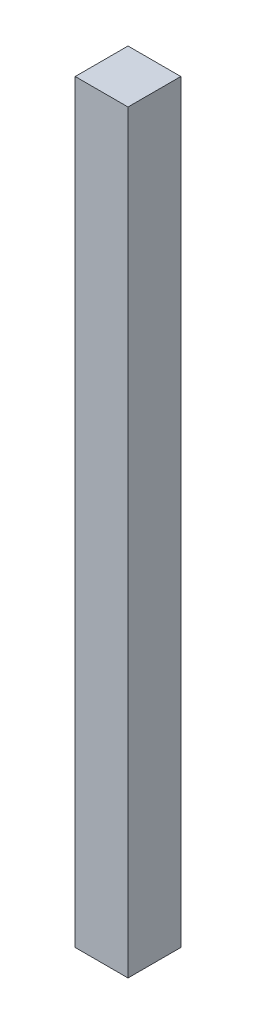
ISO-10303-21;
HEADER;
FILE_DESCRIPTION(('STEP AP214'),'2;1');
FILE_NAME('part.step','',(''),(''),'','','');
FILE_SCHEMA(('AUTOMOTIVE_DESIGN { 1 0 10303 214 1 1 1 1 }'));
ENDSEC;
DATA;
#1=APPLICATION_CONTEXT('core data for automotive mechanical design processes');
#2=APPLICATION_PROTOCOL_DEFINITION('international standard','automotive_design',2000,#1);
#3=PRODUCT_CONTEXT('',#1,'mechanical');
#4=PRODUCT('Part','Part','',(#3));
#5=PRODUCT_RELATED_PRODUCT_CATEGORY('part','',(#4));
#6=PRODUCT_DEFINITION_FORMATION('','',#4);
#7=PRODUCT_DEFINITION_CONTEXT('part definition',#1,'design');
#8=PRODUCT_DEFINITION('design','',#6,#7);
#9=PRODUCT_DEFINITION_SHAPE('','',#8);
#10=(LENGTH_UNIT() NAMED_UNIT(*) SI_UNIT(.MILLI.,.METRE.));
#11=(NAMED_UNIT(*) PLANE_ANGLE_UNIT() SI_UNIT($,.RADIAN.));
#12=(NAMED_UNIT(*) SI_UNIT($,.STERADIAN.) SOLID_ANGLE_UNIT());
#13=UNCERTAINTY_MEASURE_WITH_UNIT(LENGTH_MEASURE(1.E-05),#10,'distance_accuracy_value','');
#14=(GEOMETRIC_REPRESENTATION_CONTEXT(3) GLOBAL_UNCERTAINTY_ASSIGNED_CONTEXT((#13)) GLOBAL_UNIT_ASSIGNED_CONTEXT((#10,
#11,#12)) REPRESENTATION_CONTEXT('',''));
#15=CARTESIAN_POINT('',(0.,0.,0.));
#16=DIRECTION('',(0.,0.,1.));
#17=DIRECTION('',(1.,0.,0.));
#18=AXIS2_PLACEMENT_3D('',#15,#16,#17);
#19=CARTESIAN_POINT('',(0.,70.,0.));
#20=DIRECTION('',(1.,0.,0.));
#21=DIRECTION('',(0.,0.,-1.));
#22=AXIS2_PLACEMENT_3D('',#19,#20,#21);
#23=PLANE('',#22);
#24=DIRECTION('',(0.,0.,1.));
#25=VECTOR('',#24,1.);
#26=CARTESIAN_POINT('',(0.,0.,0.));
#27=LINE('',#26,#25);
#28=CARTESIAN_POINT('',(0.,0.,-4.9));
#29=VERTEX_POINT('',#28);
#30=CARTESIAN_POINT('',(0.,0.,0.));
#31=VERTEX_POINT('',#30);
#32=EDGE_CURVE('E96',#29,#31,#27,.T.);
#33=ORIENTED_EDGE('',*,*,#32,.T.);
#34=DIRECTION('',(0.,-1.,0.));
#35=VECTOR('',#34,1.);
#36=CARTESIAN_POINT('',(0.,70.,0.));
#37=LINE('',#36,#35);
#38=CARTESIAN_POINT('',(0.,70.,0.));
#39=VERTEX_POINT('',#38);
#40=EDGE_CURVE('E11',#39,#31,#37,.T.);
#41=ORIENTED_EDGE('',*,*,#40,.F.);
#42=DIRECTION('',(0.,0.,1.));
#43=VECTOR('',#42,1.);
#44=CARTESIAN_POINT('',(0.,70.,0.));
#45=LINE('',#44,#43);
#46=CARTESIAN_POINT('',(0.,70.,-4.9));
#47=VERTEX_POINT('',#46);
#48=EDGE_CURVE('E84',#47,#39,#45,.T.);
#49=ORIENTED_EDGE('',*,*,#48,.F.);
#50=DIRECTION('',(0.,-1.,0.));
#51=VECTOR('',#50,1.);
#52=CARTESIAN_POINT('',(0.,70.,-4.9));
#53=LINE('',#52,#51);
#54=EDGE_CURVE('E92',#47,#29,#53,.T.);
#55=ORIENTED_EDGE('',*,*,#54,.T.);
#56=EDGE_LOOP('',(#33,#41,#49,#55));
#57=FACE_BOUND('',#56,.T.);
#58=ADVANCED_FACE('F33',(#57),#23,.F.);
#59=CARTESIAN_POINT('',(0.,70.,0.));
#60=DIRECTION('',(0.,0.,-1.));
#61=DIRECTION('',(-1.,0.,0.));
#62=AXIS2_PLACEMENT_3D('',#59,#60,#61);
#63=PLANE('',#62);
#64=DIRECTION('',(1.,0.,0.));
#65=VECTOR('',#64,1.);
#66=CARTESIAN_POINT('',(0.,0.,0.));
#67=LINE('',#66,#65);
#68=CARTESIAN_POINT('',(4.9,0.,0.));
#69=VERTEX_POINT('',#68);
#70=EDGE_CURVE('E88',#31,#69,#67,.T.);
#71=ORIENTED_EDGE('',*,*,#70,.T.);
#72=DIRECTION('',(0.,-1.,0.));
#73=VECTOR('',#72,1.);
#74=CARTESIAN_POINT('',(4.9,70.,0.));
#75=LINE('',#74,#73);
#76=CARTESIAN_POINT('',(4.9,70.,0.));
#77=VERTEX_POINT('',#76);
#78=EDGE_CURVE('E41',#77,#69,#75,.T.);
#79=ORIENTED_EDGE('',*,*,#78,.F.);
#80=DIRECTION('',(1.,0.,0.));
#81=VECTOR('',#80,1.);
#82=CARTESIAN_POINT('',(0.,70.,0.));
#83=LINE('',#82,#81);
#84=EDGE_CURVE('E79',#39,#77,#83,.T.);
#85=ORIENTED_EDGE('',*,*,#84,.F.);
#86=ORIENTED_EDGE('',*,*,#40,.T.);
#87=EDGE_LOOP('',(#71,#79,#85,#86));
#88=FACE_BOUND('',#87,.T.);
#89=ADVANCED_FACE('F87',(#88),#63,.F.);
#90=CARTESIAN_POINT('',(4.9,70.,0.));
#91=DIRECTION('',(-1.,0.,0.));
#92=DIRECTION('',(0.,0.,1.));
#93=AXIS2_PLACEMENT_3D('',#90,#91,#92);
#94=PLANE('',#93);
#95=DIRECTION('',(0.,0.,-1.));
#96=VECTOR('',#95,1.);
#97=CARTESIAN_POINT('',(4.9,0.,0.));
#98=LINE('',#97,#96);
#99=CARTESIAN_POINT('',(4.9,0.,-4.9));
#100=VERTEX_POINT('',#99);
#101=EDGE_CURVE('E66',#69,#100,#98,.T.);
#102=ORIENTED_EDGE('',*,*,#101,.T.);
#103=DIRECTION('',(0.,-1.,0.));
#104=VECTOR('',#103,1.);
#105=CARTESIAN_POINT('',(4.9,70.,-4.9));
#106=LINE('',#105,#104);
#107=CARTESIAN_POINT('',(4.9,70.,-4.9));
#108=VERTEX_POINT('',#107);
#109=EDGE_CURVE('E89',#108,#100,#106,.T.);
#110=ORIENTED_EDGE('',*,*,#109,.F.);
#111=DIRECTION('',(0.,0.,-1.));
#112=VECTOR('',#111,1.);
#113=CARTESIAN_POINT('',(4.9,70.,0.));
#114=LINE('',#113,#112);
#115=EDGE_CURVE('E82',#77,#108,#114,.T.);
#116=ORIENTED_EDGE('',*,*,#115,.F.);
#117=ORIENTED_EDGE('',*,*,#78,.T.);
#118=EDGE_LOOP('',(#102,#110,#116,#117));
#119=FACE_BOUND('',#118,.T.);
#120=ADVANCED_FACE('F90',(#119),#94,.F.);
#121=CARTESIAN_POINT('',(0.,70.,-4.9));
#122=DIRECTION('',(0.,0.,1.));
#123=DIRECTION('',(1.,0.,0.));
#124=AXIS2_PLACEMENT_3D('',#121,#122,#123);
#125=PLANE('',#124);
#126=DIRECTION('',(-1.,0.,0.));
#127=VECTOR('',#126,1.);
#128=CARTESIAN_POINT('',(0.,0.,-4.9));
#129=LINE('',#128,#127);
#130=EDGE_CURVE('E72',#100,#29,#129,.T.);
#131=ORIENTED_EDGE('',*,*,#130,.T.);
#132=ORIENTED_EDGE('',*,*,#54,.F.);
#133=DIRECTION('',(-1.,0.,0.));
#134=VECTOR('',#133,1.);
#135=CARTESIAN_POINT('',(0.,70.,-4.9));
#136=LINE('',#135,#134);
#137=EDGE_CURVE('E49',#108,#47,#136,.T.);
#138=ORIENTED_EDGE('',*,*,#137,.F.);
#139=ORIENTED_EDGE('',*,*,#109,.T.);
#140=EDGE_LOOP('',(#131,#132,#138,#139));
#141=FACE_BOUND('',#140,.T.);
#142=ADVANCED_FACE('F103',(#141),#125,.F.);
#143=CARTESIAN_POINT('',(0.,70.,0.));
#144=DIRECTION('',(0.,-1.,0.));
#145=DIRECTION('',(0.,0.,-1.));
#146=AXIS2_PLACEMENT_3D('',#143,#144,#145);
#147=PLANE('',#146);
#148=ORIENTED_EDGE('',*,*,#48,.T.);
#149=ORIENTED_EDGE('',*,*,#84,.T.);
#150=ORIENTED_EDGE('',*,*,#115,.T.);
#151=ORIENTED_EDGE('',*,*,#137,.T.);
#152=EDGE_LOOP('',(#148,#149,#150,#151));
#153=FACE_BOUND('',#152,.T.);
#154=ADVANCED_FACE('F80',(#153),#147,.F.);
#155=CARTESIAN_POINT('',(0.,0.,0.));
#156=DIRECTION('',(0.,-1.,0.));
#157=DIRECTION('',(0.,0.,-1.));
#158=AXIS2_PLACEMENT_3D('',#155,#156,#157);
#159=PLANE('',#158);
#160=ORIENTED_EDGE('',*,*,#32,.F.);
#161=ORIENTED_EDGE('',*,*,#130,.F.);
#162=ORIENTED_EDGE('',*,*,#101,.F.);
#163=ORIENTED_EDGE('',*,*,#70,.F.);
#164=EDGE_LOOP('',(#160,#161,#162,#163));
#165=FACE_BOUND('',#164,.T.);
#166=ADVANCED_FACE('F106',(#165),#159,.T.);
#167=CLOSED_SHELL('',(#58,#89,#120,#142,#154,#166));
#168=MANIFOLD_SOLID_BREP('B2',#167);
#169=ADVANCED_BREP_SHAPE_REPRESENTATION('',(#18,#168),#14);
#170=SHAPE_DEFINITION_REPRESENTATION(#9,#169);
ENDSEC;
END-ISO-10303-21;
